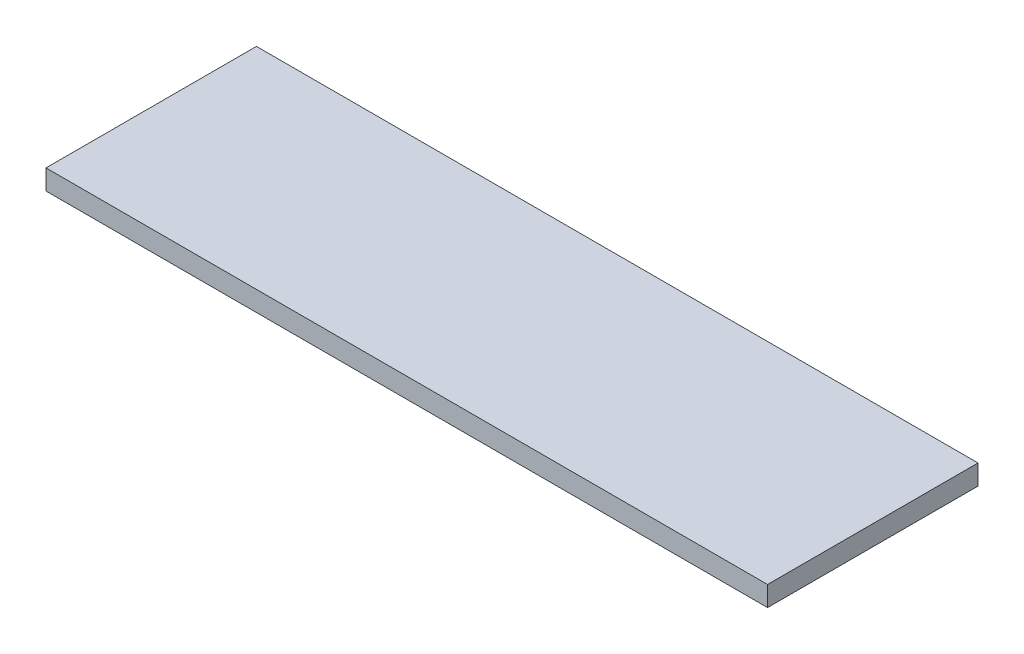
ISO-10303-21;
HEADER;
FILE_DESCRIPTION(('STEP AP214'),'2;1');
FILE_NAME('part.step','',(''),(''),'','','');
FILE_SCHEMA(('AUTOMOTIVE_DESIGN { 1 0 10303 214 1 1 1 1 }'));
ENDSEC;
DATA;
#1=APPLICATION_CONTEXT('core data for automotive mechanical design processes');
#2=APPLICATION_PROTOCOL_DEFINITION('international standard','automotive_design',2000,#1);
#3=PRODUCT_CONTEXT('',#1,'mechanical');
#4=PRODUCT('Part','Part','',(#3));
#5=PRODUCT_RELATED_PRODUCT_CATEGORY('part','',(#4));
#6=PRODUCT_DEFINITION_FORMATION('','',#4);
#7=PRODUCT_DEFINITION_CONTEXT('part definition',#1,'design');
#8=PRODUCT_DEFINITION('design','',#6,#7);
#9=PRODUCT_DEFINITION_SHAPE('','',#8);
#10=(LENGTH_UNIT() NAMED_UNIT(*) SI_UNIT(.MILLI.,.METRE.));
#11=(NAMED_UNIT(*) PLANE_ANGLE_UNIT() SI_UNIT($,.RADIAN.));
#12=(NAMED_UNIT(*) SI_UNIT($,.STERADIAN.) SOLID_ANGLE_UNIT());
#13=UNCERTAINTY_MEASURE_WITH_UNIT(LENGTH_MEASURE(1.E-05),#10,'distance_accuracy_value','');
#14=(GEOMETRIC_REPRESENTATION_CONTEXT(3) GLOBAL_UNCERTAINTY_ASSIGNED_CONTEXT((#13)) GLOBAL_UNIT_ASSIGNED_CONTEXT((#10,
#11,#12)) REPRESENTATION_CONTEXT('',''));
#15=CARTESIAN_POINT('',(0.,0.,0.));
#16=DIRECTION('',(0.,0.,1.));
#17=DIRECTION('',(1.,0.,0.));
#18=AXIS2_PLACEMENT_3D('',#15,#16,#17);
#19=CARTESIAN_POINT('',(-360.,20.,105.));
#20=DIRECTION('',(1.,0.,0.));
#21=DIRECTION('',(0.,0.,-1.));
#22=AXIS2_PLACEMENT_3D('',#19,#20,#21);
#23=PLANE('',#22);
#24=DIRECTION('',(0.,0.,1.));
#25=VECTOR('',#24,1.);
#26=CARTESIAN_POINT('',(-360.,0.,105.));
#27=LINE('',#26,#25);
#28=CARTESIAN_POINT('',(-360.,0.,-105.));
#29=VERTEX_POINT('',#28);
#30=CARTESIAN_POINT('',(-360.,0.,105.));
#31=VERTEX_POINT('',#30);
#32=EDGE_CURVE('E99',#29,#31,#27,.T.);
#33=ORIENTED_EDGE('',*,*,#32,.T.);
#34=DIRECTION('',(0.,-1.,0.));
#35=VECTOR('',#34,1.);
#36=CARTESIAN_POINT('',(-360.,20.,105.));
#37=LINE('',#36,#35);
#38=CARTESIAN_POINT('',(-360.,20.,105.));
#39=VERTEX_POINT('',#38);
#40=EDGE_CURVE('E11',#39,#31,#37,.T.);
#41=ORIENTED_EDGE('',*,*,#40,.F.);
#42=DIRECTION('',(0.,0.,1.));
#43=VECTOR('',#42,1.);
#44=CARTESIAN_POINT('',(-360.,20.,105.));
#45=LINE('',#44,#43);
#46=CARTESIAN_POINT('',(-360.,20.,-105.));
#47=VERTEX_POINT('',#46);
#48=EDGE_CURVE('E87',#47,#39,#45,.T.);
#49=ORIENTED_EDGE('',*,*,#48,.F.);
#50=DIRECTION('',(0.,-1.,0.));
#51=VECTOR('',#50,1.);
#52=CARTESIAN_POINT('',(-360.,20.,-105.));
#53=LINE('',#52,#51);
#54=EDGE_CURVE('E95',#47,#29,#53,.T.);
#55=ORIENTED_EDGE('',*,*,#54,.T.);
#56=EDGE_LOOP('',(#33,#41,#49,#55));
#57=FACE_BOUND('',#56,.T.);
#58=ADVANCED_FACE('F36',(#57),#23,.F.);
#59=CARTESIAN_POINT('',(360.,20.,105.));
#60=DIRECTION('',(0.,0.,-1.));
#61=DIRECTION('',(-1.,0.,0.));
#62=AXIS2_PLACEMENT_3D('',#59,#60,#61);
#63=PLANE('',#62);
#64=DIRECTION('',(1.,0.,0.));
#65=VECTOR('',#64,1.);
#66=CARTESIAN_POINT('',(360.,0.,105.));
#67=LINE('',#66,#65);
#68=CARTESIAN_POINT('',(360.,0.,105.));
#69=VERTEX_POINT('',#68);
#70=EDGE_CURVE('E91',#31,#69,#67,.T.);
#71=ORIENTED_EDGE('',*,*,#70,.T.);
#72=DIRECTION('',(0.,-1.,0.));
#73=VECTOR('',#72,1.);
#74=CARTESIAN_POINT('',(360.,20.,105.));
#75=LINE('',#74,#73);
#76=CARTESIAN_POINT('',(360.,20.,105.));
#77=VERTEX_POINT('',#76);
#78=EDGE_CURVE('E44',#77,#69,#75,.T.);
#79=ORIENTED_EDGE('',*,*,#78,.F.);
#80=DIRECTION('',(1.,0.,0.));
#81=VECTOR('',#80,1.);
#82=CARTESIAN_POINT('',(360.,20.,105.));
#83=LINE('',#82,#81);
#84=EDGE_CURVE('E82',#39,#77,#83,.T.);
#85=ORIENTED_EDGE('',*,*,#84,.F.);
#86=ORIENTED_EDGE('',*,*,#40,.T.);
#87=EDGE_LOOP('',(#71,#79,#85,#86));
#88=FACE_BOUND('',#87,.T.);
#89=ADVANCED_FACE('F90',(#88),#63,.F.);
#90=CARTESIAN_POINT('',(360.,20.,105.));
#91=DIRECTION('',(-1.,0.,0.));
#92=DIRECTION('',(0.,0.,1.));
#93=AXIS2_PLACEMENT_3D('',#90,#91,#92);
#94=PLANE('',#93);
#95=DIRECTION('',(0.,0.,-1.));
#96=VECTOR('',#95,1.);
#97=CARTESIAN_POINT('',(360.,0.,105.));
#98=LINE('',#97,#96);
#99=CARTESIAN_POINT('',(360.,0.,-105.));
#100=VERTEX_POINT('',#99);
#101=EDGE_CURVE('E69',#69,#100,#98,.T.);
#102=ORIENTED_EDGE('',*,*,#101,.T.);
#103=DIRECTION('',(0.,-1.,0.));
#104=VECTOR('',#103,1.);
#105=CARTESIAN_POINT('',(360.,20.,-105.));
#106=LINE('',#105,#104);
#107=CARTESIAN_POINT('',(360.,20.,-105.));
#108=VERTEX_POINT('',#107);
#109=EDGE_CURVE('E92',#108,#100,#106,.T.);
#110=ORIENTED_EDGE('',*,*,#109,.F.);
#111=DIRECTION('',(0.,0.,-1.));
#112=VECTOR('',#111,1.);
#113=CARTESIAN_POINT('',(360.,20.,105.));
#114=LINE('',#113,#112);
#115=EDGE_CURVE('E85',#77,#108,#114,.T.);
#116=ORIENTED_EDGE('',*,*,#115,.F.);
#117=ORIENTED_EDGE('',*,*,#78,.T.);
#118=EDGE_LOOP('',(#102,#110,#116,#117));
#119=FACE_BOUND('',#118,.T.);
#120=ADVANCED_FACE('F93',(#119),#94,.F.);
#121=CARTESIAN_POINT('',(360.,20.,-105.));
#122=DIRECTION('',(0.,0.,1.));
#123=DIRECTION('',(1.,0.,0.));
#124=AXIS2_PLACEMENT_3D('',#121,#122,#123);
#125=PLANE('',#124);
#126=DIRECTION('',(-1.,0.,0.));
#127=VECTOR('',#126,1.);
#128=CARTESIAN_POINT('',(360.,0.,-105.));
#129=LINE('',#128,#127);
#130=EDGE_CURVE('E75',#100,#29,#129,.T.);
#131=ORIENTED_EDGE('',*,*,#130,.T.);
#132=ORIENTED_EDGE('',*,*,#54,.F.);
#133=DIRECTION('',(-1.,0.,0.));
#134=VECTOR('',#133,1.);
#135=CARTESIAN_POINT('',(360.,20.,-105.));
#136=LINE('',#135,#134);
#137=EDGE_CURVE('E52',#108,#47,#136,.T.);
#138=ORIENTED_EDGE('',*,*,#137,.F.);
#139=ORIENTED_EDGE('',*,*,#109,.T.);
#140=EDGE_LOOP('',(#131,#132,#138,#139));
#141=FACE_BOUND('',#140,.T.);
#142=ADVANCED_FACE('F106',(#141),#125,.F.);
#143=CARTESIAN_POINT('',(0.,20.,0.));
#144=DIRECTION('',(0.,1.,0.));
#145=DIRECTION('',(0.,0.,1.));
#146=AXIS2_PLACEMENT_3D('',#143,#144,#145);
#147=PLANE('',#146);
#148=ORIENTED_EDGE('',*,*,#48,.T.);
#149=ORIENTED_EDGE('',*,*,#84,.T.);
#150=ORIENTED_EDGE('',*,*,#115,.T.);
#151=ORIENTED_EDGE('',*,*,#137,.T.);
#152=EDGE_LOOP('',(#148,#149,#150,#151));
#153=FACE_BOUND('',#152,.T.);
#154=ADVANCED_FACE('F83',(#153),#147,.T.);
#155=CARTESIAN_POINT('',(0.,0.,0.));
#156=DIRECTION('',(0.,1.,0.));
#157=DIRECTION('',(0.,0.,1.));
#158=AXIS2_PLACEMENT_3D('',#155,#156,#157);
#159=PLANE('',#158);
#160=ORIENTED_EDGE('',*,*,#32,.F.);
#161=ORIENTED_EDGE('',*,*,#130,.F.);
#162=ORIENTED_EDGE('',*,*,#101,.F.);
#163=ORIENTED_EDGE('',*,*,#70,.F.);
#164=EDGE_LOOP('',(#160,#161,#162,#163));
#165=FACE_BOUND('',#164,.T.);
#166=ADVANCED_FACE('F109',(#165),#159,.F.);
#167=CLOSED_SHELL('',(#58,#89,#120,#142,#154,#166));
#168=MANIFOLD_SOLID_BREP('B2',#167);
#169=ADVANCED_BREP_SHAPE_REPRESENTATION('',(#18,#168),#14);
#170=SHAPE_DEFINITION_REPRESENTATION(#9,#169);
ENDSEC;
END-ISO-10303-21;
